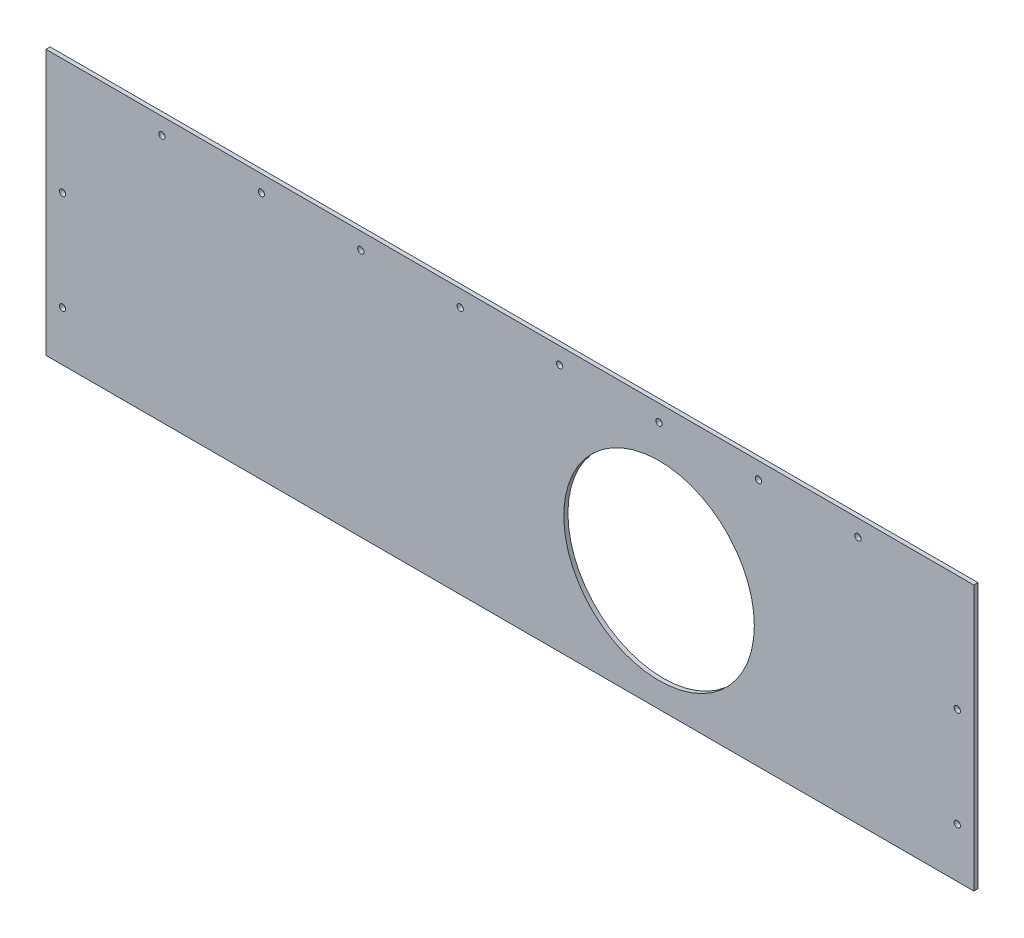
ISO-10303-21;
HEADER;
FILE_DESCRIPTION(('STEP AP214'),'2;1');
FILE_NAME('part.step','',(''),(''),'','','');
FILE_SCHEMA(('AUTOMOTIVE_DESIGN { 1 0 10303 214 1 1 1 1 }'));
ENDSEC;
DATA;
#1=APPLICATION_CONTEXT('core data for automotive mechanical design processes');
#2=APPLICATION_PROTOCOL_DEFINITION('international standard','automotive_design',2000,#1);
#3=PRODUCT_CONTEXT('',#1,'mechanical');
#4=PRODUCT('Part','Part','',(#3));
#5=PRODUCT_RELATED_PRODUCT_CATEGORY('part','',(#4));
#6=PRODUCT_DEFINITION_FORMATION('','',#4);
#7=PRODUCT_DEFINITION_CONTEXT('part definition',#1,'design');
#8=PRODUCT_DEFINITION('design','',#6,#7);
#9=PRODUCT_DEFINITION_SHAPE('','',#8);
#10=(LENGTH_UNIT() NAMED_UNIT(*) SI_UNIT(.MILLI.,.METRE.));
#11=(NAMED_UNIT(*) PLANE_ANGLE_UNIT() SI_UNIT($,.RADIAN.));
#12=(NAMED_UNIT(*) SI_UNIT($,.STERADIAN.) SOLID_ANGLE_UNIT());
#13=UNCERTAINTY_MEASURE_WITH_UNIT(LENGTH_MEASURE(1.E-05),#10,'distance_accuracy_value','');
#14=(GEOMETRIC_REPRESENTATION_CONTEXT(3) GLOBAL_UNCERTAINTY_ASSIGNED_CONTEXT((#13)) GLOBAL_UNIT_ASSIGNED_CONTEXT((#10,
#11,#12)) REPRESENTATION_CONTEXT('',''));
#15=CARTESIAN_POINT('',(0.,0.,0.));
#16=DIRECTION('',(0.,0.,1.));
#17=DIRECTION('',(1.,0.,0.));
#18=AXIS2_PLACEMENT_3D('',#15,#16,#17);
#19=CARTESIAN_POINT('',(0.,0.,3.175));
#20=DIRECTION('',(1.,0.,0.));
#21=DIRECTION('',(0.,0.,-1.));
#22=AXIS2_PLACEMENT_3D('',#19,#20,#21);
#23=PLANE('',#22);
#24=DIRECTION('',(0.,-1.,0.));
#25=VECTOR('',#24,1.);
#26=CARTESIAN_POINT('',(0.,0.,0.));
#27=LINE('',#26,#25);
#28=CARTESIAN_POINT('',(0.,203.2,0.));
#29=VERTEX_POINT('',#28);
#30=CARTESIAN_POINT('',(0.,0.,0.));
#31=VERTEX_POINT('',#30);
#32=EDGE_CURVE('E98',#29,#31,#27,.T.);
#33=ORIENTED_EDGE('',*,*,#32,.T.);
#34=DIRECTION('',(0.,0.,-1.));
#35=VECTOR('',#34,1.);
#36=CARTESIAN_POINT('',(0.,0.,3.175));
#37=LINE('',#36,#35);
#38=CARTESIAN_POINT('',(0.,0.,3.175));
#39=VERTEX_POINT('',#38);
#40=EDGE_CURVE('E11',#39,#31,#37,.T.);
#41=ORIENTED_EDGE('',*,*,#40,.F.);
#42=DIRECTION('',(0.,-1.,0.));
#43=VECTOR('',#42,1.);
#44=CARTESIAN_POINT('',(0.,0.,3.175));
#45=LINE('',#44,#43);
#46=CARTESIAN_POINT('',(0.,203.2,3.175));
#47=VERTEX_POINT('',#46);
#48=EDGE_CURVE('E86',#47,#39,#45,.T.);
#49=ORIENTED_EDGE('',*,*,#48,.F.);
#50=DIRECTION('',(0.,0.,-1.));
#51=VECTOR('',#50,1.);
#52=CARTESIAN_POINT('',(0.,203.2,3.175));
#53=LINE('',#52,#51);
#54=EDGE_CURVE('E94',#47,#29,#53,.T.);
#55=ORIENTED_EDGE('',*,*,#54,.T.);
#56=EDGE_LOOP('',(#33,#41,#49,#55));
#57=FACE_BOUND('',#56,.T.);
#58=ADVANCED_FACE('F35',(#57),#23,.F.);
#59=CARTESIAN_POINT('',(0.,0.,3.175));
#60=DIRECTION('',(0.,1.,0.));
#61=DIRECTION('',(0.,0.,1.));
#62=AXIS2_PLACEMENT_3D('',#59,#60,#61);
#63=PLANE('',#62);
#64=DIRECTION('',(1.,0.,0.));
#65=VECTOR('',#64,1.);
#66=CARTESIAN_POINT('',(0.,0.,0.));
#67=LINE('',#66,#65);
#68=CARTESIAN_POINT('',(711.2,0.,0.));
#69=VERTEX_POINT('',#68);
#70=EDGE_CURVE('E90',#31,#69,#67,.T.);
#71=ORIENTED_EDGE('',*,*,#70,.T.);
#72=DIRECTION('',(0.,0.,-1.));
#73=VECTOR('',#72,1.);
#74=CARTESIAN_POINT('',(711.2,0.,3.175));
#75=LINE('',#74,#73);
#76=CARTESIAN_POINT('',(711.2,0.,3.175));
#77=VERTEX_POINT('',#76);
#78=EDGE_CURVE('E43',#77,#69,#75,.T.);
#79=ORIENTED_EDGE('',*,*,#78,.F.);
#80=DIRECTION('',(1.,0.,0.));
#81=VECTOR('',#80,1.);
#82=CARTESIAN_POINT('',(0.,0.,3.175));
#83=LINE('',#82,#81);
#84=EDGE_CURVE('E81',#39,#77,#83,.T.);
#85=ORIENTED_EDGE('',*,*,#84,.F.);
#86=ORIENTED_EDGE('',*,*,#40,.T.);
#87=EDGE_LOOP('',(#71,#79,#85,#86));
#88=FACE_BOUND('',#87,.T.);
#89=ADVANCED_FACE('F89',(#88),#63,.F.);
#90=CARTESIAN_POINT('',(711.2,0.,3.175));
#91=DIRECTION('',(-1.,0.,0.));
#92=DIRECTION('',(0.,0.,1.));
#93=AXIS2_PLACEMENT_3D('',#90,#91,#92);
#94=PLANE('',#93);
#95=DIRECTION('',(0.,1.,0.));
#96=VECTOR('',#95,1.);
#97=CARTESIAN_POINT('',(711.2,0.,0.));
#98=LINE('',#97,#96);
#99=CARTESIAN_POINT('',(711.2,203.2,0.));
#100=VERTEX_POINT('',#99);
#101=EDGE_CURVE('E68',#69,#100,#98,.T.);
#102=ORIENTED_EDGE('',*,*,#101,.T.);
#103=DIRECTION('',(0.,0.,-1.));
#104=VECTOR('',#103,1.);
#105=CARTESIAN_POINT('',(711.2,203.2,3.175));
#106=LINE('',#105,#104);
#107=CARTESIAN_POINT('',(711.2,203.2,3.175));
#108=VERTEX_POINT('',#107);
#109=EDGE_CURVE('E91',#108,#100,#106,.T.);
#110=ORIENTED_EDGE('',*,*,#109,.F.);
#111=DIRECTION('',(0.,1.,0.));
#112=VECTOR('',#111,1.);
#113=CARTESIAN_POINT('',(711.2,0.,3.175));
#114=LINE('',#113,#112);
#115=EDGE_CURVE('E84',#77,#108,#114,.T.);
#116=ORIENTED_EDGE('',*,*,#115,.F.);
#117=ORIENTED_EDGE('',*,*,#78,.T.);
#118=EDGE_LOOP('',(#102,#110,#116,#117));
#119=FACE_BOUND('',#118,.T.);
#120=ADVANCED_FACE('F92',(#119),#94,.F.);
#121=CARTESIAN_POINT('',(0.,203.2,3.175));
#122=DIRECTION('',(0.,-1.,0.));
#123=DIRECTION('',(0.,0.,-1.));
#124=AXIS2_PLACEMENT_3D('',#121,#122,#123);
#125=PLANE('',#124);
#126=DIRECTION('',(-1.,0.,0.));
#127=VECTOR('',#126,1.);
#128=CARTESIAN_POINT('',(0.,203.2,0.));
#129=LINE('',#128,#127);
#130=EDGE_CURVE('E74',#100,#29,#129,.T.);
#131=ORIENTED_EDGE('',*,*,#130,.T.);
#132=ORIENTED_EDGE('',*,*,#54,.F.);
#133=DIRECTION('',(-1.,0.,0.));
#134=VECTOR('',#133,1.);
#135=CARTESIAN_POINT('',(0.,203.2,3.175));
#136=LINE('',#135,#134);
#137=EDGE_CURVE('E51',#108,#47,#136,.T.);
#138=ORIENTED_EDGE('',*,*,#137,.F.);
#139=ORIENTED_EDGE('',*,*,#109,.T.);
#140=EDGE_LOOP('',(#131,#132,#138,#139));
#141=FACE_BOUND('',#140,.T.);
#142=ADVANCED_FACE('F106',(#141),#125,.F.);
#143=CARTESIAN_POINT('',(0.,0.,3.175));
#144=DIRECTION('',(0.,0.,-1.));
#145=DIRECTION('',(-1.,0.,0.));
#146=AXIS2_PLACEMENT_3D('',#143,#144,#145);
#147=PLANE('',#146);
#148=CARTESIAN_POINT('',(469.9,92.075,3.175));
#149=DIRECTION('',(0.,0.,1.));
#150=DIRECTION('',(1.,0.,0.));
#151=AXIS2_PLACEMENT_3D('',#148,#149,#150);
#152=CIRCLE('',#151,73.025);
#153=CARTESIAN_POINT('',(542.925,92.075,3.175));
#154=VERTEX_POINT('',#153);
#155=EDGE_CURVE('E170',#154,#154,#152,.T.);
#156=ORIENTED_EDGE('',*,*,#155,.F.);
#157=EDGE_LOOP('',(#156));
#158=FACE_BOUND('',#157,.T.);
#159=CARTESIAN_POINT('',(546.1,190.5,3.175));
#160=DIRECTION('',(0.,0.,1.));
#161=DIRECTION('',(1.,0.,0.));
#162=AXIS2_PLACEMENT_3D('',#159,#160,#161);
#163=CIRCLE('',#162,2.413);
#164=CARTESIAN_POINT('',(548.513,190.5,3.175));
#165=VERTEX_POINT('',#164);
#166=EDGE_CURVE('E145',#165,#165,#163,.T.);
#167=ORIENTED_EDGE('',*,*,#166,.F.);
#168=EDGE_LOOP('',(#167));
#169=FACE_BOUND('',#168,.T.);
#170=CARTESIAN_POINT('',(622.3,190.5,3.175));
#171=DIRECTION('',(0.,0.,1.));
#172=DIRECTION('',(1.,0.,0.));
#173=AXIS2_PLACEMENT_3D('',#170,#171,#172);
#174=CIRCLE('',#173,2.413);
#175=CARTESIAN_POINT('',(624.713,190.5,3.175));
#176=VERTEX_POINT('',#175);
#177=EDGE_CURVE('E152',#176,#176,#174,.T.);
#178=ORIENTED_EDGE('',*,*,#177,.F.);
#179=EDGE_LOOP('',(#178));
#180=FACE_BOUND('',#179,.T.);
#181=CARTESIAN_POINT('',(241.3,190.5,3.175));
#182=DIRECTION('',(0.,0.,1.));
#183=DIRECTION('',(1.,0.,0.));
#184=AXIS2_PLACEMENT_3D('',#181,#182,#183);
#185=CIRCLE('',#184,2.413);
#186=CARTESIAN_POINT('',(243.713,190.5,3.175));
#187=VERTEX_POINT('',#186);
#188=EDGE_CURVE('E158',#187,#187,#185,.T.);
#189=ORIENTED_EDGE('',*,*,#188,.F.);
#190=EDGE_LOOP('',(#189));
#191=FACE_BOUND('',#190,.T.);
#192=CARTESIAN_POINT('',(165.1,190.5,3.175));
#193=DIRECTION('',(0.,0.,1.));
#194=DIRECTION('',(1.,0.,0.));
#195=AXIS2_PLACEMENT_3D('',#192,#193,#194);
#196=CIRCLE('',#195,2.413);
#197=CARTESIAN_POINT('',(167.513,190.5,3.175));
#198=VERTEX_POINT('',#197);
#199=EDGE_CURVE('E134',#198,#198,#196,.T.);
#200=ORIENTED_EDGE('',*,*,#199,.F.);
#201=EDGE_LOOP('',(#200));
#202=FACE_BOUND('',#201,.T.);
#203=CARTESIAN_POINT('',(12.7,114.3,3.175));
#204=DIRECTION('',(0.,0.,1.));
#205=DIRECTION('',(1.,0.,0.));
#206=AXIS2_PLACEMENT_3D('',#203,#204,#205);
#207=CIRCLE('',#206,2.413);
#208=CARTESIAN_POINT('',(15.113,114.3,3.175));
#209=VERTEX_POINT('',#208);
#210=EDGE_CURVE('E115',#209,#209,#207,.T.);
#211=ORIENTED_EDGE('',*,*,#210,.F.);
#212=EDGE_LOOP('',(#211));
#213=FACE_BOUND('',#212,.T.);
#214=CARTESIAN_POINT('',(698.5,38.1,3.175));
#215=DIRECTION('',(0.,0.,1.));
#216=DIRECTION('',(1.,0.,0.));
#217=AXIS2_PLACEMENT_3D('',#214,#215,#216);
#218=CIRCLE('',#217,2.413);
#219=CARTESIAN_POINT('',(700.913,38.1,3.175));
#220=VERTEX_POINT('',#219);
#221=EDGE_CURVE('E121',#220,#220,#218,.T.);
#222=ORIENTED_EDGE('',*,*,#221,.F.);
#223=EDGE_LOOP('',(#222));
#224=FACE_BOUND('',#223,.T.);
#225=CARTESIAN_POINT('',(12.7,38.1,3.175));
#226=DIRECTION('',(0.,0.,1.));
#227=DIRECTION('',(1.,0.,0.));
#228=AXIS2_PLACEMENT_3D('',#225,#226,#227);
#229=CIRCLE('',#228,2.413);
#230=CARTESIAN_POINT('',(15.113,38.1,3.175));
#231=VERTEX_POINT('',#230);
#232=EDGE_CURVE('E122',#231,#231,#229,.T.);
#233=ORIENTED_EDGE('',*,*,#232,.F.);
#234=EDGE_LOOP('',(#233));
#235=FACE_BOUND('',#234,.T.);
#236=CARTESIAN_POINT('',(88.9,190.5,3.175));
#237=DIRECTION('',(0.,0.,1.));
#238=DIRECTION('',(1.,0.,0.));
#239=AXIS2_PLACEMENT_3D('',#236,#237,#238);
#240=CIRCLE('',#239,2.413);
#241=CARTESIAN_POINT('',(91.313,190.5,3.175));
#242=VERTEX_POINT('',#241);
#243=EDGE_CURVE('E133',#242,#242,#240,.T.);
#244=ORIENTED_EDGE('',*,*,#243,.F.);
#245=EDGE_LOOP('',(#244));
#246=FACE_BOUND('',#245,.T.);
#247=CARTESIAN_POINT('',(469.9,190.5,3.175));
#248=DIRECTION('',(0.,0.,1.));
#249=DIRECTION('',(1.,0.,0.));
#250=AXIS2_PLACEMENT_3D('',#247,#248,#249);
#251=CIRCLE('',#250,2.413);
#252=CARTESIAN_POINT('',(472.313,190.5,3.175));
#253=VERTEX_POINT('',#252);
#254=EDGE_CURVE('E146',#253,#253,#251,.T.);
#255=ORIENTED_EDGE('',*,*,#254,.F.);
#256=EDGE_LOOP('',(#255));
#257=FACE_BOUND('',#256,.T.);
#258=CARTESIAN_POINT('',(393.7,190.5,3.175));
#259=DIRECTION('',(0.,0.,1.));
#260=DIRECTION('',(1.,0.,0.));
#261=AXIS2_PLACEMENT_3D('',#258,#259,#260);
#262=CIRCLE('',#261,2.413);
#263=CARTESIAN_POINT('',(396.113,190.5,3.175));
#264=VERTEX_POINT('',#263);
#265=EDGE_CURVE('E176',#264,#264,#262,.T.);
#266=ORIENTED_EDGE('',*,*,#265,.F.);
#267=EDGE_LOOP('',(#266));
#268=FACE_BOUND('',#267,.T.);
#269=CARTESIAN_POINT('',(317.5,190.5,3.175));
#270=DIRECTION('',(0.,0.,1.));
#271=DIRECTION('',(1.,0.,0.));
#272=AXIS2_PLACEMENT_3D('',#269,#270,#271);
#273=CIRCLE('',#272,2.413);
#274=CARTESIAN_POINT('',(319.913,190.5,3.175));
#275=VERTEX_POINT('',#274);
#276=EDGE_CURVE('E169',#275,#275,#273,.T.);
#277=ORIENTED_EDGE('',*,*,#276,.F.);
#278=EDGE_LOOP('',(#277));
#279=FACE_BOUND('',#278,.T.);
#280=CARTESIAN_POINT('',(698.5,114.3,3.175));
#281=DIRECTION('',(0.,0.,1.));
#282=DIRECTION('',(1.,0.,0.));
#283=AXIS2_PLACEMENT_3D('',#280,#281,#282);
#284=CIRCLE('',#283,2.413);
#285=CARTESIAN_POINT('',(700.913,114.3,3.175));
#286=VERTEX_POINT('',#285);
#287=EDGE_CURVE('E101',#286,#286,#284,.T.);
#288=ORIENTED_EDGE('',*,*,#287,.F.);
#289=EDGE_LOOP('',(#288));
#290=FACE_BOUND('',#289,.T.);
#291=ORIENTED_EDGE('',*,*,#48,.T.);
#292=ORIENTED_EDGE('',*,*,#84,.T.);
#293=ORIENTED_EDGE('',*,*,#115,.T.);
#294=ORIENTED_EDGE('',*,*,#137,.T.);
#295=EDGE_LOOP('',(#291,#292,#293,#294));
#296=FACE_BOUND('',#295,.T.);
#297=ADVANCED_FACE('F82',(#158,#169,#180,#191,#202,#213,#224,#235,#246,#257,#268,#279,#290,
#296),#147,.F.);
#298=CARTESIAN_POINT('',(0.,0.,0.));
#299=DIRECTION('',(0.,0.,-1.));
#300=DIRECTION('',(-1.,0.,0.));
#301=AXIS2_PLACEMENT_3D('',#298,#299,#300);
#302=PLANE('',#301);
#303=CARTESIAN_POINT('',(469.9,92.075,0.));
#304=DIRECTION('',(0.,0.,-1.));
#305=DIRECTION('',(-1.,0.,0.));
#306=AXIS2_PLACEMENT_3D('',#303,#304,#305);
#307=CIRCLE('',#306,73.025);
#308=CARTESIAN_POINT('',(396.875,92.075,0.));
#309=VERTEX_POINT('',#308);
#310=EDGE_CURVE('E184',#309,#309,#307,.F.);
#311=ORIENTED_EDGE('',*,*,#310,.T.);
#312=EDGE_LOOP('',(#311));
#313=FACE_BOUND('',#312,.T.);
#314=CARTESIAN_POINT('',(546.1,190.5,0.));
#315=DIRECTION('',(0.,0.,-1.));
#316=DIRECTION('',(-1.,0.,0.));
#317=AXIS2_PLACEMENT_3D('',#314,#315,#316);
#318=CIRCLE('',#317,2.413);
#319=CARTESIAN_POINT('',(543.687,190.5,0.));
#320=VERTEX_POINT('',#319);
#321=EDGE_CURVE('E142',#320,#320,#318,.F.);
#322=ORIENTED_EDGE('',*,*,#321,.T.);
#323=EDGE_LOOP('',(#322));
#324=FACE_BOUND('',#323,.T.);
#325=CARTESIAN_POINT('',(622.3,190.5,0.));
#326=DIRECTION('',(0.,0.,-1.));
#327=DIRECTION('',(-1.,0.,0.));
#328=AXIS2_PLACEMENT_3D('',#325,#326,#327);
#329=CIRCLE('',#328,2.413);
#330=CARTESIAN_POINT('',(619.887,190.5,0.));
#331=VERTEX_POINT('',#330);
#332=EDGE_CURVE('E149',#331,#331,#329,.F.);
#333=ORIENTED_EDGE('',*,*,#332,.T.);
#334=EDGE_LOOP('',(#333));
#335=FACE_BOUND('',#334,.T.);
#336=CARTESIAN_POINT('',(241.3,190.5,0.));
#337=DIRECTION('',(0.,0.,-1.));
#338=DIRECTION('',(-1.,0.,0.));
#339=AXIS2_PLACEMENT_3D('',#336,#337,#338);
#340=CIRCLE('',#339,2.413);
#341=CARTESIAN_POINT('',(238.887,190.5,0.));
#342=VERTEX_POINT('',#341);
#343=EDGE_CURVE('E155',#342,#342,#340,.F.);
#344=ORIENTED_EDGE('',*,*,#343,.T.);
#345=EDGE_LOOP('',(#344));
#346=FACE_BOUND('',#345,.T.);
#347=CARTESIAN_POINT('',(165.1,190.5,0.));
#348=DIRECTION('',(0.,0.,-1.));
#349=DIRECTION('',(-1.,0.,0.));
#350=AXIS2_PLACEMENT_3D('',#347,#348,#349);
#351=CIRCLE('',#350,2.413);
#352=CARTESIAN_POINT('',(162.687,190.5,0.));
#353=VERTEX_POINT('',#352);
#354=EDGE_CURVE('E161',#353,#353,#351,.F.);
#355=ORIENTED_EDGE('',*,*,#354,.T.);
#356=EDGE_LOOP('',(#355));
#357=FACE_BOUND('',#356,.T.);
#358=CARTESIAN_POINT('',(12.7,114.3,0.));
#359=DIRECTION('',(0.,0.,-1.));
#360=DIRECTION('',(-1.,0.,0.));
#361=AXIS2_PLACEMENT_3D('',#358,#359,#360);
#362=CIRCLE('',#361,2.413);
#363=CARTESIAN_POINT('',(10.287,114.3,0.));
#364=VERTEX_POINT('',#363);
#365=EDGE_CURVE('E125',#364,#364,#362,.F.);
#366=ORIENTED_EDGE('',*,*,#365,.T.);
#367=EDGE_LOOP('',(#366));
#368=FACE_BOUND('',#367,.T.);
#369=CARTESIAN_POINT('',(698.5,38.1,0.));
#370=DIRECTION('',(0.,0.,-1.));
#371=DIRECTION('',(-1.,0.,0.));
#372=AXIS2_PLACEMENT_3D('',#369,#370,#371);
#373=CIRCLE('',#372,2.413);
#374=CARTESIAN_POINT('',(696.087,38.1,0.));
#375=VERTEX_POINT('',#374);
#376=EDGE_CURVE('E118',#375,#375,#373,.F.);
#377=ORIENTED_EDGE('',*,*,#376,.T.);
#378=EDGE_LOOP('',(#377));
#379=FACE_BOUND('',#378,.T.);
#380=CARTESIAN_POINT('',(12.7,38.1,0.));
#381=DIRECTION('',(0.,0.,-1.));
#382=DIRECTION('',(-1.,0.,0.));
#383=AXIS2_PLACEMENT_3D('',#380,#381,#382);
#384=CIRCLE('',#383,2.413);
#385=CARTESIAN_POINT('',(10.287,38.1,0.));
#386=VERTEX_POINT('',#385);
#387=EDGE_CURVE('E137',#386,#386,#384,.F.);
#388=ORIENTED_EDGE('',*,*,#387,.T.);
#389=EDGE_LOOP('',(#388));
#390=FACE_BOUND('',#389,.T.);
#391=CARTESIAN_POINT('',(88.9,190.5,0.));
#392=DIRECTION('',(0.,0.,-1.));
#393=DIRECTION('',(-1.,0.,0.));
#394=AXIS2_PLACEMENT_3D('',#391,#392,#393);
#395=CIRCLE('',#394,2.413);
#396=CARTESIAN_POINT('',(86.4870000000001,190.5,0.));
#397=VERTEX_POINT('',#396);
#398=EDGE_CURVE('E130',#397,#397,#395,.F.);
#399=ORIENTED_EDGE('',*,*,#398,.T.);
#400=EDGE_LOOP('',(#399));
#401=FACE_BOUND('',#400,.T.);
#402=CARTESIAN_POINT('',(469.9,190.5,0.));
#403=DIRECTION('',(0.,0.,-1.));
#404=DIRECTION('',(-1.,0.,0.));
#405=AXIS2_PLACEMENT_3D('',#402,#403,#404);
#406=CIRCLE('',#405,2.413);
#407=CARTESIAN_POINT('',(467.487,190.5,0.));
#408=VERTEX_POINT('',#407);
#409=EDGE_CURVE('E179',#408,#408,#406,.F.);
#410=ORIENTED_EDGE('',*,*,#409,.T.);
#411=EDGE_LOOP('',(#410));
#412=FACE_BOUND('',#411,.T.);
#413=CARTESIAN_POINT('',(393.7,190.5,0.));
#414=DIRECTION('',(0.,0.,-1.));
#415=DIRECTION('',(-1.,0.,0.));
#416=AXIS2_PLACEMENT_3D('',#413,#414,#415);
#417=CIRCLE('',#416,2.413);
#418=CARTESIAN_POINT('',(391.287,190.5,0.));
#419=VERTEX_POINT('',#418);
#420=EDGE_CURVE('E173',#419,#419,#417,.F.);
#421=ORIENTED_EDGE('',*,*,#420,.T.);
#422=EDGE_LOOP('',(#421));
#423=FACE_BOUND('',#422,.T.);
#424=CARTESIAN_POINT('',(317.5,190.5,0.));
#425=DIRECTION('',(0.,0.,-1.));
#426=DIRECTION('',(-1.,0.,0.));
#427=AXIS2_PLACEMENT_3D('',#424,#425,#426);
#428=CIRCLE('',#427,2.413);
#429=CARTESIAN_POINT('',(315.087,190.5,0.));
#430=VERTEX_POINT('',#429);
#431=EDGE_CURVE('E166',#430,#430,#428,.F.);
#432=ORIENTED_EDGE('',*,*,#431,.T.);
#433=EDGE_LOOP('',(#432));
#434=FACE_BOUND('',#433,.T.);
#435=CARTESIAN_POINT('',(698.5,114.3,0.));
#436=DIRECTION('',(0.,0.,-1.));
#437=DIRECTION('',(-1.,0.,0.));
#438=AXIS2_PLACEMENT_3D('',#435,#436,#437);
#439=CIRCLE('',#438,2.413);
#440=CARTESIAN_POINT('',(696.087,114.3,0.));
#441=VERTEX_POINT('',#440);
#442=EDGE_CURVE('E112',#441,#441,#439,.F.);
#443=ORIENTED_EDGE('',*,*,#442,.T.);
#444=EDGE_LOOP('',(#443));
#445=FACE_BOUND('',#444,.T.);
#446=ORIENTED_EDGE('',*,*,#32,.F.);
#447=ORIENTED_EDGE('',*,*,#130,.F.);
#448=ORIENTED_EDGE('',*,*,#101,.F.);
#449=ORIENTED_EDGE('',*,*,#70,.F.);
#450=EDGE_LOOP('',(#446,#447,#448,#449));
#451=FACE_BOUND('',#450,.T.);
#452=ADVANCED_FACE('F109',(#313,#324,#335,#346,#357,#368,#379,#390,#401,#412,#423,#434,#445,
#451),#302,.T.);
#453=CARTESIAN_POINT('',(698.5,114.3,-0.00100000000000013));
#454=DIRECTION('',(0.,0.,1.));
#455=DIRECTION('',(1.,0.,0.));
#456=AXIS2_PLACEMENT_3D('',#453,#454,#455);
#457=CYLINDRICAL_SURFACE('',#456,2.413);
#458=ORIENTED_EDGE('',*,*,#442,.F.);
#459=EDGE_LOOP('',(#458));
#460=FACE_BOUND('',#459,.T.);
#461=ORIENTED_EDGE('',*,*,#287,.T.);
#462=EDGE_LOOP('',(#461));
#463=FACE_BOUND('',#462,.T.);
#464=ADVANCED_FACE('F219',(#460,#463),#457,.F.);
#465=CARTESIAN_POINT('',(317.5,190.5,-0.00100000000000013));
#466=DIRECTION('',(0.,0.,1.));
#467=DIRECTION('',(1.,0.,0.));
#468=AXIS2_PLACEMENT_3D('',#465,#466,#467);
#469=CYLINDRICAL_SURFACE('',#468,2.413);
#470=ORIENTED_EDGE('',*,*,#431,.F.);
#471=EDGE_LOOP('',(#470));
#472=FACE_BOUND('',#471,.T.);
#473=ORIENTED_EDGE('',*,*,#276,.T.);
#474=EDGE_LOOP('',(#473));
#475=FACE_BOUND('',#474,.T.);
#476=ADVANCED_FACE('F221',(#472,#475),#469,.F.);
#477=CARTESIAN_POINT('',(393.7,190.5,-0.00100000000000013));
#478=DIRECTION('',(0.,0.,1.));
#479=DIRECTION('',(1.,0.,0.));
#480=AXIS2_PLACEMENT_3D('',#477,#478,#479);
#481=CYLINDRICAL_SURFACE('',#480,2.413);
#482=ORIENTED_EDGE('',*,*,#420,.F.);
#483=EDGE_LOOP('',(#482));
#484=FACE_BOUND('',#483,.T.);
#485=ORIENTED_EDGE('',*,*,#265,.T.);
#486=EDGE_LOOP('',(#485));
#487=FACE_BOUND('',#486,.T.);
#488=ADVANCED_FACE('F228',(#484,#487),#481,.F.);
#489=CARTESIAN_POINT('',(469.9,190.5,-0.00100000000000013));
#490=DIRECTION('',(0.,0.,1.));
#491=DIRECTION('',(1.,0.,0.));
#492=AXIS2_PLACEMENT_3D('',#489,#490,#491);
#493=CYLINDRICAL_SURFACE('',#492,2.413);
#494=ORIENTED_EDGE('',*,*,#409,.F.);
#495=EDGE_LOOP('',(#494));
#496=FACE_BOUND('',#495,.T.);
#497=ORIENTED_EDGE('',*,*,#254,.T.);
#498=EDGE_LOOP('',(#497));
#499=FACE_BOUND('',#498,.T.);
#500=ADVANCED_FACE('F333',(#496,#499),#493,.F.);
#501=CARTESIAN_POINT('',(88.9,190.5,-0.00100000000000013));
#502=DIRECTION('',(0.,0.,1.));
#503=DIRECTION('',(1.,0.,0.));
#504=AXIS2_PLACEMENT_3D('',#501,#502,#503);
#505=CYLINDRICAL_SURFACE('',#504,2.413);
#506=ORIENTED_EDGE('',*,*,#398,.F.);
#507=EDGE_LOOP('',(#506));
#508=FACE_BOUND('',#507,.T.);
#509=ORIENTED_EDGE('',*,*,#243,.T.);
#510=EDGE_LOOP('',(#509));
#511=FACE_BOUND('',#510,.T.);
#512=ADVANCED_FACE('F325',(#508,#511),#505,.F.);
#513=CARTESIAN_POINT('',(12.7,38.1,-0.00100000000000013));
#514=DIRECTION('',(0.,0.,1.));
#515=DIRECTION('',(1.,0.,0.));
#516=AXIS2_PLACEMENT_3D('',#513,#514,#515);
#517=CYLINDRICAL_SURFACE('',#516,2.413);
#518=ORIENTED_EDGE('',*,*,#387,.F.);
#519=EDGE_LOOP('',(#518));
#520=FACE_BOUND('',#519,.T.);
#521=ORIENTED_EDGE('',*,*,#232,.T.);
#522=EDGE_LOOP('',(#521));
#523=FACE_BOUND('',#522,.T.);
#524=ADVANCED_FACE('F318',(#520,#523),#517,.F.);
#525=CARTESIAN_POINT('',(698.5,38.1,-0.00100000000000013));
#526=DIRECTION('',(0.,0.,1.));
#527=DIRECTION('',(1.,0.,0.));
#528=AXIS2_PLACEMENT_3D('',#525,#526,#527);
#529=CYLINDRICAL_SURFACE('',#528,2.413);
#530=ORIENTED_EDGE('',*,*,#376,.F.);
#531=EDGE_LOOP('',(#530));
#532=FACE_BOUND('',#531,.T.);
#533=ORIENTED_EDGE('',*,*,#221,.T.);
#534=EDGE_LOOP('',(#533));
#535=FACE_BOUND('',#534,.T.);
#536=ADVANCED_FACE('F310',(#532,#535),#529,.F.);
#537=CARTESIAN_POINT('',(12.7,114.3,-0.00100000000000013));
#538=DIRECTION('',(0.,0.,1.));
#539=DIRECTION('',(1.,0.,0.));
#540=AXIS2_PLACEMENT_3D('',#537,#538,#539);
#541=CYLINDRICAL_SURFACE('',#540,2.413);
#542=ORIENTED_EDGE('',*,*,#365,.F.);
#543=EDGE_LOOP('',(#542));
#544=FACE_BOUND('',#543,.T.);
#545=ORIENTED_EDGE('',*,*,#210,.T.);
#546=EDGE_LOOP('',(#545));
#547=FACE_BOUND('',#546,.T.);
#548=ADVANCED_FACE('F302',(#544,#547),#541,.F.);
#549=CARTESIAN_POINT('',(165.1,190.5,-0.00100000000000013));
#550=DIRECTION('',(0.,0.,1.));
#551=DIRECTION('',(1.,0.,0.));
#552=AXIS2_PLACEMENT_3D('',#549,#550,#551);
#553=CYLINDRICAL_SURFACE('',#552,2.413);
#554=ORIENTED_EDGE('',*,*,#354,.F.);
#555=EDGE_LOOP('',(#554));
#556=FACE_BOUND('',#555,.T.);
#557=ORIENTED_EDGE('',*,*,#199,.T.);
#558=EDGE_LOOP('',(#557));
#559=FACE_BOUND('',#558,.T.);
#560=ADVANCED_FACE('F294',(#556,#559),#553,.F.);
#561=CARTESIAN_POINT('',(241.3,190.5,-0.00100000000000013));
#562=DIRECTION('',(0.,0.,1.));
#563=DIRECTION('',(1.,0.,0.));
#564=AXIS2_PLACEMENT_3D('',#561,#562,#563);
#565=CYLINDRICAL_SURFACE('',#564,2.413);
#566=ORIENTED_EDGE('',*,*,#343,.F.);
#567=EDGE_LOOP('',(#566));
#568=FACE_BOUND('',#567,.T.);
#569=ORIENTED_EDGE('',*,*,#188,.T.);
#570=EDGE_LOOP('',(#569));
#571=FACE_BOUND('',#570,.T.);
#572=ADVANCED_FACE('F286',(#568,#571),#565,.F.);
#573=CARTESIAN_POINT('',(622.3,190.5,-0.00100000000000013));
#574=DIRECTION('',(0.,0.,1.));
#575=DIRECTION('',(1.,0.,0.));
#576=AXIS2_PLACEMENT_3D('',#573,#574,#575);
#577=CYLINDRICAL_SURFACE('',#576,2.413);
#578=ORIENTED_EDGE('',*,*,#332,.F.);
#579=EDGE_LOOP('',(#578));
#580=FACE_BOUND('',#579,.T.);
#581=ORIENTED_EDGE('',*,*,#177,.T.);
#582=EDGE_LOOP('',(#581));
#583=FACE_BOUND('',#582,.T.);
#584=ADVANCED_FACE('F279',(#580,#583),#577,.F.);
#585=CARTESIAN_POINT('',(546.1,190.5,-0.00100000000000013));
#586=DIRECTION('',(0.,0.,1.));
#587=DIRECTION('',(1.,0.,0.));
#588=AXIS2_PLACEMENT_3D('',#585,#586,#587);
#589=CYLINDRICAL_SURFACE('',#588,2.413);
#590=ORIENTED_EDGE('',*,*,#321,.F.);
#591=EDGE_LOOP('',(#590));
#592=FACE_BOUND('',#591,.T.);
#593=ORIENTED_EDGE('',*,*,#166,.T.);
#594=EDGE_LOOP('',(#593));
#595=FACE_BOUND('',#594,.T.);
#596=ADVANCED_FACE('F269',(#592,#595),#589,.F.);
#597=CARTESIAN_POINT('',(469.9,92.075,-0.00100000000000013));
#598=DIRECTION('',(0.,0.,1.));
#599=DIRECTION('',(1.,0.,0.));
#600=AXIS2_PLACEMENT_3D('',#597,#598,#599);
#601=CYLINDRICAL_SURFACE('',#600,73.025);
#602=ORIENTED_EDGE('',*,*,#310,.F.);
#603=EDGE_LOOP('',(#602));
#604=FACE_BOUND('',#603,.T.);
#605=ORIENTED_EDGE('',*,*,#155,.T.);
#606=EDGE_LOOP('',(#605));
#607=FACE_BOUND('',#606,.T.);
#608=ADVANCED_FACE('F190',(#604,#607),#601,.F.);
#609=CLOSED_SHELL('',(#58,#89,#120,#142,#297,#452,#464,#476,#488,#500,#512,#524,#536,#548,#560,
#572,#584,#596,#608));
#610=MANIFOLD_SOLID_BREP('B2',#609);
#611=ADVANCED_BREP_SHAPE_REPRESENTATION('',(#18,#610),#14);
#612=SHAPE_DEFINITION_REPRESENTATION(#9,#611);
ENDSEC;
END-ISO-10303-21;
